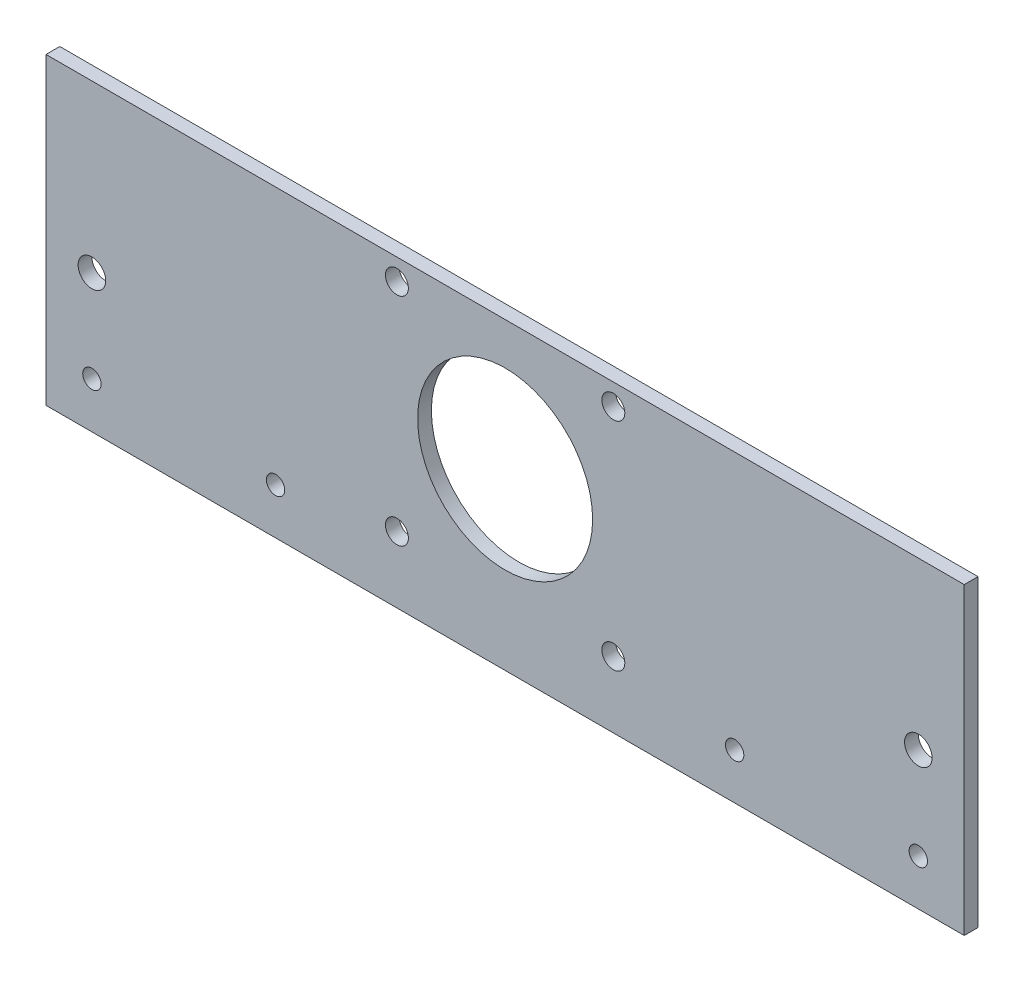
ISO-10303-21;
HEADER;
FILE_DESCRIPTION(('STEP AP214'),'2;1');
FILE_NAME('part.step','',(''),(''),'','','');
FILE_SCHEMA(('AUTOMOTIVE_DESIGN { 1 0 10303 214 1 1 1 1 }'));
ENDSEC;
DATA;
#1=APPLICATION_CONTEXT('core data for automotive mechanical design processes');
#2=APPLICATION_PROTOCOL_DEFINITION('international standard','automotive_design',2000,#1);
#3=PRODUCT_CONTEXT('',#1,'mechanical');
#4=PRODUCT('Part','Part','',(#3));
#5=PRODUCT_RELATED_PRODUCT_CATEGORY('part','',(#4));
#6=PRODUCT_DEFINITION_FORMATION('','',#4);
#7=PRODUCT_DEFINITION_CONTEXT('part definition',#1,'design');
#8=PRODUCT_DEFINITION('design','',#6,#7);
#9=PRODUCT_DEFINITION_SHAPE('','',#8);
#10=(LENGTH_UNIT() NAMED_UNIT(*) SI_UNIT(.MILLI.,.METRE.));
#11=(NAMED_UNIT(*) PLANE_ANGLE_UNIT() SI_UNIT($,.RADIAN.));
#12=(NAMED_UNIT(*) SI_UNIT($,.STERADIAN.) SOLID_ANGLE_UNIT());
#13=UNCERTAINTY_MEASURE_WITH_UNIT(LENGTH_MEASURE(1.E-05),#10,'distance_accuracy_value','');
#14=(GEOMETRIC_REPRESENTATION_CONTEXT(3) GLOBAL_UNCERTAINTY_ASSIGNED_CONTEXT((#13)) GLOBAL_UNIT_ASSIGNED_CONTEXT((#10,
#11,#12)) REPRESENTATION_CONTEXT('',''));
#15=CARTESIAN_POINT('',(0.,0.,0.));
#16=DIRECTION('',(0.,0.,1.));
#17=DIRECTION('',(1.,0.,0.));
#18=AXIS2_PLACEMENT_3D('',#15,#16,#17);
#19=CARTESIAN_POINT('',(0.,0.,3.));
#20=DIRECTION('',(1.,0.,0.));
#21=DIRECTION('',(0.,0.,-1.));
#22=AXIS2_PLACEMENT_3D('',#19,#20,#21);
#23=PLANE('',#22);
#24=DIRECTION('',(0.,-1.,0.));
#25=VECTOR('',#24,1.);
#26=CARTESIAN_POINT('',(0.,0.,0.));
#27=LINE('',#26,#25);
#28=CARTESIAN_POINT('',(0.,66.2,0.));
#29=VERTEX_POINT('',#28);
#30=CARTESIAN_POINT('',(0.,0.,0.));
#31=VERTEX_POINT('',#30);
#32=EDGE_CURVE('E98',#29,#31,#27,.T.);
#33=ORIENTED_EDGE('',*,*,#32,.T.);
#34=DIRECTION('',(0.,0.,-1.));
#35=VECTOR('',#34,1.);
#36=CARTESIAN_POINT('',(0.,0.,3.));
#37=LINE('',#36,#35);
#38=CARTESIAN_POINT('',(0.,0.,3.));
#39=VERTEX_POINT('',#38);
#40=EDGE_CURVE('E11',#39,#31,#37,.T.);
#41=ORIENTED_EDGE('',*,*,#40,.F.);
#42=DIRECTION('',(0.,-1.,0.));
#43=VECTOR('',#42,1.);
#44=CARTESIAN_POINT('',(0.,0.,3.));
#45=LINE('',#44,#43);
#46=CARTESIAN_POINT('',(0.,66.2,3.));
#47=VERTEX_POINT('',#46);
#48=EDGE_CURVE('E85',#47,#39,#45,.T.);
#49=ORIENTED_EDGE('',*,*,#48,.F.);
#50=DIRECTION('',(0.,0.,-1.));
#51=VECTOR('',#50,1.);
#52=CARTESIAN_POINT('',(0.,66.2,3.));
#53=LINE('',#52,#51);
#54=EDGE_CURVE('E94',#47,#29,#53,.T.);
#55=ORIENTED_EDGE('',*,*,#54,.T.);
#56=EDGE_LOOP('',(#33,#41,#49,#55));
#57=FACE_BOUND('',#56,.T.);
#58=ADVANCED_FACE('F33',(#57),#23,.F.);
#59=CARTESIAN_POINT('',(0.,0.,3.));
#60=DIRECTION('',(0.,1.,0.));
#61=DIRECTION('',(0.,0.,1.));
#62=AXIS2_PLACEMENT_3D('',#59,#60,#61);
#63=PLANE('',#62);
#64=DIRECTION('',(1.,0.,0.));
#65=VECTOR('',#64,1.);
#66=CARTESIAN_POINT('',(0.,0.,0.));
#67=LINE('',#66,#65);
#68=CARTESIAN_POINT('',(200.,0.,0.));
#69=VERTEX_POINT('',#68);
#70=EDGE_CURVE('E89',#31,#69,#67,.T.);
#71=ORIENTED_EDGE('',*,*,#70,.T.);
#72=DIRECTION('',(0.,0.,-1.));
#73=VECTOR('',#72,1.);
#74=CARTESIAN_POINT('',(200.,0.,3.));
#75=LINE('',#74,#73);
#76=CARTESIAN_POINT('',(200.,0.,3.));
#77=VERTEX_POINT('',#76);
#78=EDGE_CURVE('E42',#77,#69,#75,.T.);
#79=ORIENTED_EDGE('',*,*,#78,.F.);
#80=DIRECTION('',(1.,0.,0.));
#81=VECTOR('',#80,1.);
#82=CARTESIAN_POINT('',(0.,0.,3.));
#83=LINE('',#82,#81);
#84=EDGE_CURVE('E80',#39,#77,#83,.T.);
#85=ORIENTED_EDGE('',*,*,#84,.F.);
#86=ORIENTED_EDGE('',*,*,#40,.T.);
#87=EDGE_LOOP('',(#71,#79,#85,#86));
#88=FACE_BOUND('',#87,.T.);
#89=ADVANCED_FACE('F88',(#88),#63,.F.);
#90=CARTESIAN_POINT('',(200.,0.,3.));
#91=DIRECTION('',(-1.,0.,0.));
#92=DIRECTION('',(0.,0.,1.));
#93=AXIS2_PLACEMENT_3D('',#90,#91,#92);
#94=PLANE('',#93);
#95=DIRECTION('',(0.,1.,0.));
#96=VECTOR('',#95,1.);
#97=CARTESIAN_POINT('',(200.,0.,0.));
#98=LINE('',#97,#96);
#99=CARTESIAN_POINT('',(200.,66.2,0.));
#100=VERTEX_POINT('',#99);
#101=EDGE_CURVE('E67',#69,#100,#98,.T.);
#102=ORIENTED_EDGE('',*,*,#101,.T.);
#103=DIRECTION('',(0.,0.,-1.));
#104=VECTOR('',#103,1.);
#105=CARTESIAN_POINT('',(200.,66.2,3.));
#106=LINE('',#105,#104);
#107=CARTESIAN_POINT('',(200.,66.2,3.));
#108=VERTEX_POINT('',#107);
#109=EDGE_CURVE('E90',#108,#100,#106,.T.);
#110=ORIENTED_EDGE('',*,*,#109,.F.);
#111=DIRECTION('',(0.,1.,0.));
#112=VECTOR('',#111,1.);
#113=CARTESIAN_POINT('',(200.,0.,3.));
#114=LINE('',#113,#112);
#115=EDGE_CURVE('E83',#77,#108,#114,.T.);
#116=ORIENTED_EDGE('',*,*,#115,.F.);
#117=ORIENTED_EDGE('',*,*,#78,.T.);
#118=EDGE_LOOP('',(#102,#110,#116,#117));
#119=FACE_BOUND('',#118,.T.);
#120=ADVANCED_FACE('F92',(#119),#94,.F.);
#121=CARTESIAN_POINT('',(0.,66.2,3.));
#122=DIRECTION('',(0.,-1.,0.));
#123=DIRECTION('',(0.,0.,-1.));
#124=AXIS2_PLACEMENT_3D('',#121,#122,#123);
#125=PLANE('',#124);
#126=DIRECTION('',(-1.,0.,0.));
#127=VECTOR('',#126,1.);
#128=CARTESIAN_POINT('',(0.,66.2,0.));
#129=LINE('',#128,#127);
#130=EDGE_CURVE('E73',#100,#29,#129,.T.);
#131=ORIENTED_EDGE('',*,*,#130,.T.);
#132=ORIENTED_EDGE('',*,*,#54,.F.);
#133=DIRECTION('',(-1.,0.,0.));
#134=VECTOR('',#133,1.);
#135=CARTESIAN_POINT('',(0.,66.2,3.));
#136=LINE('',#135,#134);
#137=EDGE_CURVE('E50',#108,#47,#136,.T.);
#138=ORIENTED_EDGE('',*,*,#137,.F.);
#139=ORIENTED_EDGE('',*,*,#109,.T.);
#140=EDGE_LOOP('',(#131,#132,#138,#139));
#141=FACE_BOUND('',#140,.T.);
#142=ADVANCED_FACE('F105',(#141),#125,.F.);
#143=CARTESIAN_POINT('',(0.,0.,3.));
#144=DIRECTION('',(0.,0.,-1.));
#145=DIRECTION('',(-1.,0.,0.));
#146=AXIS2_PLACEMENT_3D('',#143,#144,#145);
#147=PLANE('',#146);
#148=CARTESIAN_POINT('',(76.43,14.43,3.));
#149=DIRECTION('',(0.,0.,-1.));
#150=DIRECTION('',(-1.,0.,0.));
#151=AXIS2_PLACEMENT_3D('',#148,#149,#150);
#152=CIRCLE('',#151,2.50000000000001);
#153=CARTESIAN_POINT('',(73.93,14.43,3.));
#154=VERTEX_POINT('',#153);
#155=EDGE_CURVE('E168',#154,#154,#152,.T.);
#156=ORIENTED_EDGE('',*,*,#155,.T.);
#157=EDGE_LOOP('',(#156));
#158=FACE_BOUND('',#157,.T.);
#159=CARTESIAN_POINT('',(123.57,14.43,3.));
#160=DIRECTION('',(0.,0.,-1.));
#161=DIRECTION('',(-1.,0.,0.));
#162=AXIS2_PLACEMENT_3D('',#159,#160,#161);
#163=CIRCLE('',#162,2.5);
#164=CARTESIAN_POINT('',(121.07,14.43,3.));
#165=VERTEX_POINT('',#164);
#166=EDGE_CURVE('E162',#165,#165,#163,.T.);
#167=ORIENTED_EDGE('',*,*,#166,.T.);
#168=EDGE_LOOP('',(#167));
#169=FACE_BOUND('',#168,.T.);
#170=CARTESIAN_POINT('',(123.57,61.57,3.));
#171=DIRECTION('',(0.,0.,-1.));
#172=DIRECTION('',(-1.,0.,0.));
#173=AXIS2_PLACEMENT_3D('',#170,#171,#172);
#174=CIRCLE('',#173,2.5);
#175=CARTESIAN_POINT('',(121.07,61.57,3.));
#176=VERTEX_POINT('',#175);
#177=EDGE_CURVE('E156',#176,#176,#174,.T.);
#178=ORIENTED_EDGE('',*,*,#177,.T.);
#179=EDGE_LOOP('',(#178));
#180=FACE_BOUND('',#179,.T.);
#181=CARTESIAN_POINT('',(76.43,61.57,3.));
#182=DIRECTION('',(0.,0.,-1.));
#183=DIRECTION('',(-1.,0.,0.));
#184=AXIS2_PLACEMENT_3D('',#181,#182,#183);
#185=CIRCLE('',#184,2.50000000000001);
#186=CARTESIAN_POINT('',(73.93,61.57,3.));
#187=VERTEX_POINT('',#186);
#188=EDGE_CURVE('E150',#187,#187,#185,.T.);
#189=ORIENTED_EDGE('',*,*,#188,.T.);
#190=EDGE_LOOP('',(#189));
#191=FACE_BOUND('',#190,.T.);
#192=CARTESIAN_POINT('',(10.,30.,3.));
#193=DIRECTION('',(0.,0.,-1.));
#194=DIRECTION('',(-1.,0.,0.));
#195=AXIS2_PLACEMENT_3D('',#192,#193,#194);
#196=CIRCLE('',#195,3.);
#197=CARTESIAN_POINT('',(7.,30.,3.));
#198=VERTEX_POINT('',#197);
#199=EDGE_CURVE('E144',#198,#198,#196,.T.);
#200=ORIENTED_EDGE('',*,*,#199,.T.);
#201=EDGE_LOOP('',(#200));
#202=FACE_BOUND('',#201,.T.);
#203=CARTESIAN_POINT('',(190.,30.,3.));
#204=DIRECTION('',(0.,0.,-1.));
#205=DIRECTION('',(-1.,0.,0.));
#206=AXIS2_PLACEMENT_3D('',#203,#204,#205);
#207=CIRCLE('',#206,2.99999999999999);
#208=CARTESIAN_POINT('',(187.,30.,3.));
#209=VERTEX_POINT('',#208);
#210=EDGE_CURVE('E138',#209,#209,#207,.T.);
#211=ORIENTED_EDGE('',*,*,#210,.T.);
#212=EDGE_LOOP('',(#211));
#213=FACE_BOUND('',#212,.T.);
#214=CARTESIAN_POINT('',(10.,10.,3.));
#215=DIRECTION('',(0.,0.,-1.));
#216=DIRECTION('',(-1.,0.,0.));
#217=AXIS2_PLACEMENT_3D('',#214,#215,#216);
#218=CIRCLE('',#217,2.);
#219=CARTESIAN_POINT('',(8.,10.,3.));
#220=VERTEX_POINT('',#219);
#221=EDGE_CURVE('E132',#220,#220,#218,.T.);
#222=ORIENTED_EDGE('',*,*,#221,.T.);
#223=EDGE_LOOP('',(#222));
#224=FACE_BOUND('',#223,.T.);
#225=CARTESIAN_POINT('',(50.,10.,3.));
#226=DIRECTION('',(0.,0.,-1.));
#227=DIRECTION('',(-1.,0.,0.));
#228=AXIS2_PLACEMENT_3D('',#225,#226,#227);
#229=CIRCLE('',#228,2.);
#230=CARTESIAN_POINT('',(48.,10.,3.));
#231=VERTEX_POINT('',#230);
#232=EDGE_CURVE('E126',#231,#231,#229,.T.);
#233=ORIENTED_EDGE('',*,*,#232,.T.);
#234=EDGE_LOOP('',(#233));
#235=FACE_BOUND('',#234,.T.);
#236=CARTESIAN_POINT('',(150.,10.,3.));
#237=DIRECTION('',(0.,0.,-1.));
#238=DIRECTION('',(-1.,0.,0.));
#239=AXIS2_PLACEMENT_3D('',#236,#237,#238);
#240=CIRCLE('',#239,2.);
#241=CARTESIAN_POINT('',(148.,10.,3.));
#242=VERTEX_POINT('',#241);
#243=EDGE_CURVE('E120',#242,#242,#240,.T.);
#244=ORIENTED_EDGE('',*,*,#243,.T.);
#245=EDGE_LOOP('',(#244));
#246=FACE_BOUND('',#245,.T.);
#247=CARTESIAN_POINT('',(190.,10.,3.));
#248=DIRECTION('',(0.,0.,-1.));
#249=DIRECTION('',(-1.,0.,0.));
#250=AXIS2_PLACEMENT_3D('',#247,#248,#249);
#251=CIRCLE('',#250,2.);
#252=CARTESIAN_POINT('',(188.,10.,3.));
#253=VERTEX_POINT('',#252);
#254=EDGE_CURVE('E114',#253,#253,#251,.T.);
#255=ORIENTED_EDGE('',*,*,#254,.T.);
#256=EDGE_LOOP('',(#255));
#257=FACE_BOUND('',#256,.T.);
#258=CARTESIAN_POINT('',(100.,38.,3.));
#259=DIRECTION('',(0.,0.,1.));
#260=DIRECTION('',(1.,0.,0.));
#261=AXIS2_PLACEMENT_3D('',#258,#259,#260);
#262=CIRCLE('',#261,19.0625);
#263=CARTESIAN_POINT('',(119.0625,38.,3.));
#264=VERTEX_POINT('',#263);
#265=EDGE_CURVE('E111',#264,#264,#262,.T.);
#266=ORIENTED_EDGE('',*,*,#265,.F.);
#267=EDGE_LOOP('',(#266));
#268=FACE_BOUND('',#267,.T.);
#269=ORIENTED_EDGE('',*,*,#48,.T.);
#270=ORIENTED_EDGE('',*,*,#84,.T.);
#271=ORIENTED_EDGE('',*,*,#115,.T.);
#272=ORIENTED_EDGE('',*,*,#137,.T.);
#273=EDGE_LOOP('',(#269,#270,#271,#272));
#274=FACE_BOUND('',#273,.T.);
#275=ADVANCED_FACE('F81',(#158,#169,#180,#191,#202,#213,#224,#235,#246,#257,#268,#274),#147,.F.);
#276=CARTESIAN_POINT('',(0.,0.,0.));
#277=DIRECTION('',(0.,0.,-1.));
#278=DIRECTION('',(-1.,0.,0.));
#279=AXIS2_PLACEMENT_3D('',#276,#277,#278);
#280=PLANE('',#279);
#281=CARTESIAN_POINT('',(76.43,14.43,0.));
#282=DIRECTION('',(0.,0.,-1.));
#283=DIRECTION('',(-1.,0.,0.));
#284=AXIS2_PLACEMENT_3D('',#281,#282,#283);
#285=CIRCLE('',#284,2.50000000000001);
#286=CARTESIAN_POINT('',(73.93,14.43,0.));
#287=VERTEX_POINT('',#286);
#288=EDGE_CURVE('E171',#287,#287,#285,.T.);
#289=ORIENTED_EDGE('',*,*,#288,.F.);
#290=EDGE_LOOP('',(#289));
#291=FACE_BOUND('',#290,.T.);
#292=CARTESIAN_POINT('',(123.57,14.43,0.));
#293=DIRECTION('',(0.,0.,-1.));
#294=DIRECTION('',(-1.,0.,0.));
#295=AXIS2_PLACEMENT_3D('',#292,#293,#294);
#296=CIRCLE('',#295,2.5);
#297=CARTESIAN_POINT('',(121.07,14.43,0.));
#298=VERTEX_POINT('',#297);
#299=EDGE_CURVE('E165',#298,#298,#296,.T.);
#300=ORIENTED_EDGE('',*,*,#299,.F.);
#301=EDGE_LOOP('',(#300));
#302=FACE_BOUND('',#301,.T.);
#303=CARTESIAN_POINT('',(123.57,61.57,0.));
#304=DIRECTION('',(0.,0.,-1.));
#305=DIRECTION('',(-1.,0.,0.));
#306=AXIS2_PLACEMENT_3D('',#303,#304,#305);
#307=CIRCLE('',#306,2.5);
#308=CARTESIAN_POINT('',(121.07,61.57,0.));
#309=VERTEX_POINT('',#308);
#310=EDGE_CURVE('E159',#309,#309,#307,.T.);
#311=ORIENTED_EDGE('',*,*,#310,.F.);
#312=EDGE_LOOP('',(#311));
#313=FACE_BOUND('',#312,.T.);
#314=CARTESIAN_POINT('',(76.43,61.57,0.));
#315=DIRECTION('',(0.,0.,-1.));
#316=DIRECTION('',(-1.,0.,0.));
#317=AXIS2_PLACEMENT_3D('',#314,#315,#316);
#318=CIRCLE('',#317,2.50000000000001);
#319=CARTESIAN_POINT('',(73.93,61.57,0.));
#320=VERTEX_POINT('',#319);
#321=EDGE_CURVE('E153',#320,#320,#318,.T.);
#322=ORIENTED_EDGE('',*,*,#321,.F.);
#323=EDGE_LOOP('',(#322));
#324=FACE_BOUND('',#323,.T.);
#325=CARTESIAN_POINT('',(10.,30.,0.));
#326=DIRECTION('',(0.,0.,-1.));
#327=DIRECTION('',(-1.,0.,0.));
#328=AXIS2_PLACEMENT_3D('',#325,#326,#327);
#329=CIRCLE('',#328,3.);
#330=CARTESIAN_POINT('',(7.,30.,0.));
#331=VERTEX_POINT('',#330);
#332=EDGE_CURVE('E147',#331,#331,#329,.T.);
#333=ORIENTED_EDGE('',*,*,#332,.F.);
#334=EDGE_LOOP('',(#333));
#335=FACE_BOUND('',#334,.T.);
#336=CARTESIAN_POINT('',(190.,30.,0.));
#337=DIRECTION('',(0.,0.,-1.));
#338=DIRECTION('',(-1.,0.,0.));
#339=AXIS2_PLACEMENT_3D('',#336,#337,#338);
#340=CIRCLE('',#339,2.99999999999999);
#341=CARTESIAN_POINT('',(187.,30.,0.));
#342=VERTEX_POINT('',#341);
#343=EDGE_CURVE('E141',#342,#342,#340,.T.);
#344=ORIENTED_EDGE('',*,*,#343,.F.);
#345=EDGE_LOOP('',(#344));
#346=FACE_BOUND('',#345,.T.);
#347=CARTESIAN_POINT('',(10.,10.,0.));
#348=DIRECTION('',(0.,0.,-1.));
#349=DIRECTION('',(-1.,0.,0.));
#350=AXIS2_PLACEMENT_3D('',#347,#348,#349);
#351=CIRCLE('',#350,2.);
#352=CARTESIAN_POINT('',(8.,10.,0.));
#353=VERTEX_POINT('',#352);
#354=EDGE_CURVE('E135',#353,#353,#351,.T.);
#355=ORIENTED_EDGE('',*,*,#354,.F.);
#356=EDGE_LOOP('',(#355));
#357=FACE_BOUND('',#356,.T.);
#358=CARTESIAN_POINT('',(50.,10.,0.));
#359=DIRECTION('',(0.,0.,-1.));
#360=DIRECTION('',(-1.,0.,0.));
#361=AXIS2_PLACEMENT_3D('',#358,#359,#360);
#362=CIRCLE('',#361,2.);
#363=CARTESIAN_POINT('',(48.,10.,0.));
#364=VERTEX_POINT('',#363);
#365=EDGE_CURVE('E129',#364,#364,#362,.T.);
#366=ORIENTED_EDGE('',*,*,#365,.F.);
#367=EDGE_LOOP('',(#366));
#368=FACE_BOUND('',#367,.T.);
#369=CARTESIAN_POINT('',(150.,10.,0.));
#370=DIRECTION('',(0.,0.,-1.));
#371=DIRECTION('',(-1.,0.,0.));
#372=AXIS2_PLACEMENT_3D('',#369,#370,#371);
#373=CIRCLE('',#372,2.);
#374=CARTESIAN_POINT('',(148.,10.,0.));
#375=VERTEX_POINT('',#374);
#376=EDGE_CURVE('E123',#375,#375,#373,.T.);
#377=ORIENTED_EDGE('',*,*,#376,.F.);
#378=EDGE_LOOP('',(#377));
#379=FACE_BOUND('',#378,.T.);
#380=CARTESIAN_POINT('',(190.,10.,0.));
#381=DIRECTION('',(0.,0.,-1.));
#382=DIRECTION('',(-1.,0.,0.));
#383=AXIS2_PLACEMENT_3D('',#380,#381,#382);
#384=CIRCLE('',#383,2.);
#385=CARTESIAN_POINT('',(188.,10.,0.));
#386=VERTEX_POINT('',#385);
#387=EDGE_CURVE('E117',#386,#386,#384,.T.);
#388=ORIENTED_EDGE('',*,*,#387,.F.);
#389=EDGE_LOOP('',(#388));
#390=FACE_BOUND('',#389,.T.);
#391=CARTESIAN_POINT('',(100.,38.,0.));
#392=DIRECTION('',(0.,0.,-1.));
#393=DIRECTION('',(-1.,0.,0.));
#394=AXIS2_PLACEMENT_3D('',#391,#392,#393);
#395=CIRCLE('',#394,19.0625);
#396=CARTESIAN_POINT('',(80.9375,38.,0.));
#397=VERTEX_POINT('',#396);
#398=EDGE_CURVE('E36',#397,#397,#395,.T.);
#399=ORIENTED_EDGE('',*,*,#398,.F.);
#400=EDGE_LOOP('',(#399));
#401=FACE_BOUND('',#400,.T.);
#402=ORIENTED_EDGE('',*,*,#32,.F.);
#403=ORIENTED_EDGE('',*,*,#130,.F.);
#404=ORIENTED_EDGE('',*,*,#101,.F.);
#405=ORIENTED_EDGE('',*,*,#70,.F.);
#406=EDGE_LOOP('',(#402,#403,#404,#405));
#407=FACE_BOUND('',#406,.T.);
#408=ADVANCED_FACE('F108',(#291,#302,#313,#324,#335,#346,#357,#368,#379,#390,#401,#407),#280,.T.);
#409=CARTESIAN_POINT('',(100.,38.,-21.));
#410=DIRECTION('',(0.,0.,1.));
#411=DIRECTION('',(1.,0.,0.));
#412=AXIS2_PLACEMENT_3D('',#409,#410,#411);
#413=CYLINDRICAL_SURFACE('',#412,19.0625);
#414=ORIENTED_EDGE('',*,*,#398,.T.);
#415=EDGE_LOOP('',(#414));
#416=FACE_BOUND('',#415,.T.);
#417=ORIENTED_EDGE('',*,*,#265,.T.);
#418=EDGE_LOOP('',(#417));
#419=FACE_BOUND('',#418,.T.);
#420=ADVANCED_FACE('F180',(#416,#419),#413,.F.);
#421=CARTESIAN_POINT('',(190.,10.,10.));
#422=DIRECTION('',(0.,0.,-1.));
#423=DIRECTION('',(-1.,0.,0.));
#424=AXIS2_PLACEMENT_3D('',#421,#422,#423);
#425=CYLINDRICAL_SURFACE('',#424,2.);
#426=ORIENTED_EDGE('',*,*,#387,.T.);
#427=EDGE_LOOP('',(#426));
#428=FACE_BOUND('',#427,.T.);
#429=ORIENTED_EDGE('',*,*,#254,.F.);
#430=EDGE_LOOP('',(#429));
#431=FACE_BOUND('',#430,.T.);
#432=ADVANCED_FACE('F205',(#428,#431),#425,.F.);
#433=CARTESIAN_POINT('',(150.,10.,10.));
#434=DIRECTION('',(0.,0.,-1.));
#435=DIRECTION('',(-1.,0.,0.));
#436=AXIS2_PLACEMENT_3D('',#433,#434,#435);
#437=CYLINDRICAL_SURFACE('',#436,2.);
#438=ORIENTED_EDGE('',*,*,#376,.T.);
#439=EDGE_LOOP('',(#438));
#440=FACE_BOUND('',#439,.T.);
#441=ORIENTED_EDGE('',*,*,#243,.F.);
#442=EDGE_LOOP('',(#441));
#443=FACE_BOUND('',#442,.T.);
#444=ADVANCED_FACE('F248',(#440,#443),#437,.F.);
#445=CARTESIAN_POINT('',(50.,10.,10.));
#446=DIRECTION('',(0.,0.,-1.));
#447=DIRECTION('',(-1.,0.,0.));
#448=AXIS2_PLACEMENT_3D('',#445,#446,#447);
#449=CYLINDRICAL_SURFACE('',#448,2.);
#450=ORIENTED_EDGE('',*,*,#365,.T.);
#451=EDGE_LOOP('',(#450));
#452=FACE_BOUND('',#451,.T.);
#453=ORIENTED_EDGE('',*,*,#232,.F.);
#454=EDGE_LOOP('',(#453));
#455=FACE_BOUND('',#454,.T.);
#456=ADVANCED_FACE('F258',(#452,#455),#449,.F.);
#457=CARTESIAN_POINT('',(10.,10.,10.));
#458=DIRECTION('',(0.,0.,-1.));
#459=DIRECTION('',(-1.,0.,0.));
#460=AXIS2_PLACEMENT_3D('',#457,#458,#459);
#461=CYLINDRICAL_SURFACE('',#460,2.);
#462=ORIENTED_EDGE('',*,*,#354,.T.);
#463=EDGE_LOOP('',(#462));
#464=FACE_BOUND('',#463,.T.);
#465=ORIENTED_EDGE('',*,*,#221,.F.);
#466=EDGE_LOOP('',(#465));
#467=FACE_BOUND('',#466,.T.);
#468=ADVANCED_FACE('F268',(#464,#467),#461,.F.);
#469=CARTESIAN_POINT('',(190.,30.,10.));
#470=DIRECTION('',(0.,0.,-1.));
#471=DIRECTION('',(-1.,0.,0.));
#472=AXIS2_PLACEMENT_3D('',#469,#470,#471);
#473=CYLINDRICAL_SURFACE('',#472,2.99999999999999);
#474=ORIENTED_EDGE('',*,*,#343,.T.);
#475=EDGE_LOOP('',(#474));
#476=FACE_BOUND('',#475,.T.);
#477=ORIENTED_EDGE('',*,*,#210,.F.);
#478=EDGE_LOOP('',(#477));
#479=FACE_BOUND('',#478,.T.);
#480=ADVANCED_FACE('F278',(#476,#479),#473,.F.);
#481=CARTESIAN_POINT('',(10.,30.,10.));
#482=DIRECTION('',(0.,0.,-1.));
#483=DIRECTION('',(-1.,0.,0.));
#484=AXIS2_PLACEMENT_3D('',#481,#482,#483);
#485=CYLINDRICAL_SURFACE('',#484,3.);
#486=ORIENTED_EDGE('',*,*,#332,.T.);
#487=EDGE_LOOP('',(#486));
#488=FACE_BOUND('',#487,.T.);
#489=ORIENTED_EDGE('',*,*,#199,.F.);
#490=EDGE_LOOP('',(#489));
#491=FACE_BOUND('',#490,.T.);
#492=ADVANCED_FACE('F288',(#488,#491),#485,.F.);
#493=CARTESIAN_POINT('',(76.43,61.57,10.));
#494=DIRECTION('',(0.,0.,-1.));
#495=DIRECTION('',(-1.,0.,0.));
#496=AXIS2_PLACEMENT_3D('',#493,#494,#495);
#497=CYLINDRICAL_SURFACE('',#496,2.50000000000001);
#498=ORIENTED_EDGE('',*,*,#321,.T.);
#499=EDGE_LOOP('',(#498));
#500=FACE_BOUND('',#499,.T.);
#501=ORIENTED_EDGE('',*,*,#188,.F.);
#502=EDGE_LOOP('',(#501));
#503=FACE_BOUND('',#502,.T.);
#504=ADVANCED_FACE('F297',(#500,#503),#497,.F.);
#505=CARTESIAN_POINT('',(123.57,61.57,10.));
#506=DIRECTION('',(0.,0.,-1.));
#507=DIRECTION('',(-1.,0.,0.));
#508=AXIS2_PLACEMENT_3D('',#505,#506,#507);
#509=CYLINDRICAL_SURFACE('',#508,2.5);
#510=ORIENTED_EDGE('',*,*,#310,.T.);
#511=EDGE_LOOP('',(#510));
#512=FACE_BOUND('',#511,.T.);
#513=ORIENTED_EDGE('',*,*,#177,.F.);
#514=EDGE_LOOP('',(#513));
#515=FACE_BOUND('',#514,.T.);
#516=ADVANCED_FACE('F316',(#512,#515),#509,.F.);
#517=CARTESIAN_POINT('',(123.57,14.43,10.));
#518=DIRECTION('',(0.,0.,-1.));
#519=DIRECTION('',(-1.,0.,0.));
#520=AXIS2_PLACEMENT_3D('',#517,#518,#519);
#521=CYLINDRICAL_SURFACE('',#520,2.5);
#522=ORIENTED_EDGE('',*,*,#299,.T.);
#523=EDGE_LOOP('',(#522));
#524=FACE_BOUND('',#523,.T.);
#525=ORIENTED_EDGE('',*,*,#166,.F.);
#526=EDGE_LOOP('',(#525));
#527=FACE_BOUND('',#526,.T.);
#528=ADVANCED_FACE('F326',(#524,#527),#521,.F.);
#529=CARTESIAN_POINT('',(76.43,14.43,10.));
#530=DIRECTION('',(0.,0.,-1.));
#531=DIRECTION('',(-1.,0.,0.));
#532=AXIS2_PLACEMENT_3D('',#529,#530,#531);
#533=CYLINDRICAL_SURFACE('',#532,2.50000000000001);
#534=ORIENTED_EDGE('',*,*,#288,.T.);
#535=EDGE_LOOP('',(#534));
#536=FACE_BOUND('',#535,.T.);
#537=ORIENTED_EDGE('',*,*,#155,.F.);
#538=EDGE_LOOP('',(#537));
#539=FACE_BOUND('',#538,.T.);
#540=ADVANCED_FACE('F175',(#536,#539),#533,.F.);
#541=CLOSED_SHELL('',(#58,#89,#120,#142,#275,#408,#420,#432,#444,#456,#468,#480,#492,#504,#516,
#528,#540));
#542=MANIFOLD_SOLID_BREP('B2',#541);
#543=ADVANCED_BREP_SHAPE_REPRESENTATION('',(#18,#542),#14);
#544=SHAPE_DEFINITION_REPRESENTATION(#9,#543);
ENDSEC;
END-ISO-10303-21;
